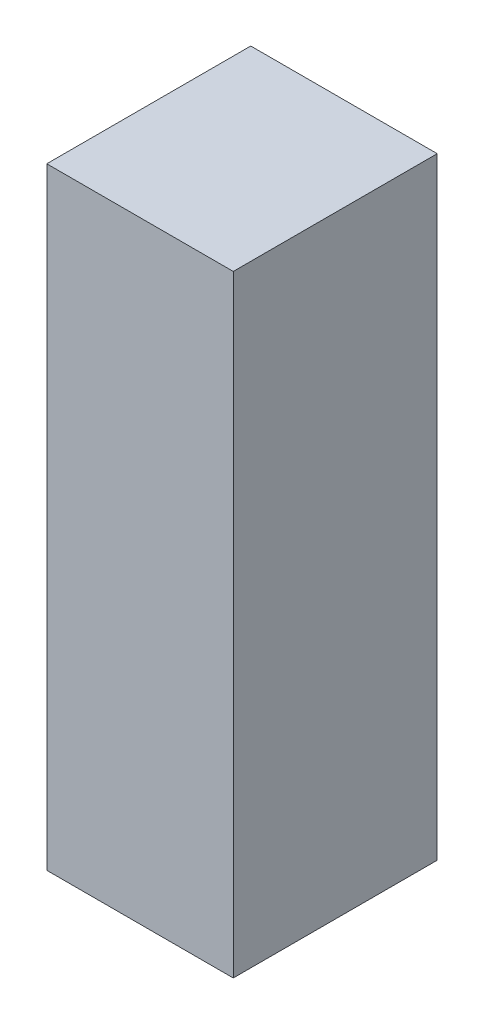
ISO-10303-21;
HEADER;
FILE_DESCRIPTION(('STEP AP214'),'2;1');
FILE_NAME('part.step','',(''),(''),'','','');
FILE_SCHEMA(('AUTOMOTIVE_DESIGN { 1 0 10303 214 1 1 1 1 }'));
ENDSEC;
DATA;
#1=APPLICATION_CONTEXT('core data for automotive mechanical design processes');
#2=APPLICATION_PROTOCOL_DEFINITION('international standard','automotive_design',2000,#1);
#3=PRODUCT_CONTEXT('',#1,'mechanical');
#4=PRODUCT('Part','Part','',(#3));
#5=PRODUCT_RELATED_PRODUCT_CATEGORY('part','',(#4));
#6=PRODUCT_DEFINITION_FORMATION('','',#4);
#7=PRODUCT_DEFINITION_CONTEXT('part definition',#1,'design');
#8=PRODUCT_DEFINITION('design','',#6,#7);
#9=PRODUCT_DEFINITION_SHAPE('','',#8);
#10=(LENGTH_UNIT() NAMED_UNIT(*) SI_UNIT(.MILLI.,.METRE.));
#11=(NAMED_UNIT(*) PLANE_ANGLE_UNIT() SI_UNIT($,.RADIAN.));
#12=(NAMED_UNIT(*) SI_UNIT($,.STERADIAN.) SOLID_ANGLE_UNIT());
#13=UNCERTAINTY_MEASURE_WITH_UNIT(LENGTH_MEASURE(1.E-05),#10,'distance_accuracy_value','');
#14=(GEOMETRIC_REPRESENTATION_CONTEXT(3) GLOBAL_UNCERTAINTY_ASSIGNED_CONTEXT((#13)) GLOBAL_UNIT_ASSIGNED_CONTEXT((#10,
#11,#12)) REPRESENTATION_CONTEXT('',''));
#15=CARTESIAN_POINT('',(0.,0.,0.));
#16=DIRECTION('',(0.,0.,1.));
#17=DIRECTION('',(1.,0.,0.));
#18=AXIS2_PLACEMENT_3D('',#15,#16,#17);
#19=CARTESIAN_POINT('',(0.,105.,0.));
#20=DIRECTION('',(1.,0.,0.));
#21=DIRECTION('',(0.,0.,-1.));
#22=AXIS2_PLACEMENT_3D('',#19,#20,#21);
#23=PLANE('',#22);
#24=DIRECTION('',(0.,0.,1.));
#25=VECTOR('',#24,1.);
#26=CARTESIAN_POINT('',(0.,0.,0.));
#27=LINE('',#26,#25);
#28=CARTESIAN_POINT('',(0.,0.,-35.));
#29=VERTEX_POINT('',#28);
#30=CARTESIAN_POINT('',(0.,0.,0.));
#31=VERTEX_POINT('',#30);
#32=EDGE_CURVE('E96',#29,#31,#27,.T.);
#33=ORIENTED_EDGE('',*,*,#32,.T.);
#34=DIRECTION('',(0.,-1.,0.));
#35=VECTOR('',#34,1.);
#36=CARTESIAN_POINT('',(0.,105.,0.));
#37=LINE('',#36,#35);
#38=CARTESIAN_POINT('',(0.,105.,0.));
#39=VERTEX_POINT('',#38);
#40=EDGE_CURVE('E11',#39,#31,#37,.T.);
#41=ORIENTED_EDGE('',*,*,#40,.F.);
#42=DIRECTION('',(0.,0.,1.));
#43=VECTOR('',#42,1.);
#44=CARTESIAN_POINT('',(0.,105.,0.));
#45=LINE('',#44,#43);
#46=CARTESIAN_POINT('',(0.,105.,-35.));
#47=VERTEX_POINT('',#46);
#48=EDGE_CURVE('E84',#47,#39,#45,.T.);
#49=ORIENTED_EDGE('',*,*,#48,.F.);
#50=DIRECTION('',(0.,-1.,0.));
#51=VECTOR('',#50,1.);
#52=CARTESIAN_POINT('',(0.,105.,-35.));
#53=LINE('',#52,#51);
#54=EDGE_CURVE('E92',#47,#29,#53,.T.);
#55=ORIENTED_EDGE('',*,*,#54,.T.);
#56=EDGE_LOOP('',(#33,#41,#49,#55));
#57=FACE_BOUND('',#56,.T.);
#58=ADVANCED_FACE('F33',(#57),#23,.F.);
#59=CARTESIAN_POINT('',(0.,105.,0.));
#60=DIRECTION('',(0.,0.,-1.));
#61=DIRECTION('',(-1.,0.,0.));
#62=AXIS2_PLACEMENT_3D('',#59,#60,#61);
#63=PLANE('',#62);
#64=DIRECTION('',(1.,0.,0.));
#65=VECTOR('',#64,1.);
#66=CARTESIAN_POINT('',(0.,0.,0.));
#67=LINE('',#66,#65);
#68=CARTESIAN_POINT('',(32.,0.,0.));
#69=VERTEX_POINT('',#68);
#70=EDGE_CURVE('E88',#31,#69,#67,.T.);
#71=ORIENTED_EDGE('',*,*,#70,.T.);
#72=DIRECTION('',(0.,-1.,0.));
#73=VECTOR('',#72,1.);
#74=CARTESIAN_POINT('',(32.,105.,0.));
#75=LINE('',#74,#73);
#76=CARTESIAN_POINT('',(32.,105.,0.));
#77=VERTEX_POINT('',#76);
#78=EDGE_CURVE('E41',#77,#69,#75,.T.);
#79=ORIENTED_EDGE('',*,*,#78,.F.);
#80=DIRECTION('',(1.,0.,0.));
#81=VECTOR('',#80,1.);
#82=CARTESIAN_POINT('',(0.,105.,0.));
#83=LINE('',#82,#81);
#84=EDGE_CURVE('E79',#39,#77,#83,.T.);
#85=ORIENTED_EDGE('',*,*,#84,.F.);
#86=ORIENTED_EDGE('',*,*,#40,.T.);
#87=EDGE_LOOP('',(#71,#79,#85,#86));
#88=FACE_BOUND('',#87,.T.);
#89=ADVANCED_FACE('F87',(#88),#63,.F.);
#90=CARTESIAN_POINT('',(32.,105.,0.));
#91=DIRECTION('',(-1.,0.,0.));
#92=DIRECTION('',(0.,0.,1.));
#93=AXIS2_PLACEMENT_3D('',#90,#91,#92);
#94=PLANE('',#93);
#95=DIRECTION('',(0.,0.,-1.));
#96=VECTOR('',#95,1.);
#97=CARTESIAN_POINT('',(32.,0.,0.));
#98=LINE('',#97,#96);
#99=CARTESIAN_POINT('',(32.,0.,-35.));
#100=VERTEX_POINT('',#99);
#101=EDGE_CURVE('E66',#69,#100,#98,.T.);
#102=ORIENTED_EDGE('',*,*,#101,.T.);
#103=DIRECTION('',(0.,-1.,0.));
#104=VECTOR('',#103,1.);
#105=CARTESIAN_POINT('',(32.,105.,-35.));
#106=LINE('',#105,#104);
#107=CARTESIAN_POINT('',(32.,105.,-35.));
#108=VERTEX_POINT('',#107);
#109=EDGE_CURVE('E89',#108,#100,#106,.T.);
#110=ORIENTED_EDGE('',*,*,#109,.F.);
#111=DIRECTION('',(0.,0.,-1.));
#112=VECTOR('',#111,1.);
#113=CARTESIAN_POINT('',(32.,105.,0.));
#114=LINE('',#113,#112);
#115=EDGE_CURVE('E82',#77,#108,#114,.T.);
#116=ORIENTED_EDGE('',*,*,#115,.F.);
#117=ORIENTED_EDGE('',*,*,#78,.T.);
#118=EDGE_LOOP('',(#102,#110,#116,#117));
#119=FACE_BOUND('',#118,.T.);
#120=ADVANCED_FACE('F90',(#119),#94,.F.);
#121=CARTESIAN_POINT('',(0.,105.,-35.));
#122=DIRECTION('',(0.,0.,1.));
#123=DIRECTION('',(1.,0.,0.));
#124=AXIS2_PLACEMENT_3D('',#121,#122,#123);
#125=PLANE('',#124);
#126=DIRECTION('',(-1.,0.,0.));
#127=VECTOR('',#126,1.);
#128=CARTESIAN_POINT('',(0.,0.,-35.));
#129=LINE('',#128,#127);
#130=EDGE_CURVE('E72',#100,#29,#129,.T.);
#131=ORIENTED_EDGE('',*,*,#130,.T.);
#132=ORIENTED_EDGE('',*,*,#54,.F.);
#133=DIRECTION('',(-1.,0.,0.));
#134=VECTOR('',#133,1.);
#135=CARTESIAN_POINT('',(0.,105.,-35.));
#136=LINE('',#135,#134);
#137=EDGE_CURVE('E49',#108,#47,#136,.T.);
#138=ORIENTED_EDGE('',*,*,#137,.F.);
#139=ORIENTED_EDGE('',*,*,#109,.T.);
#140=EDGE_LOOP('',(#131,#132,#138,#139));
#141=FACE_BOUND('',#140,.T.);
#142=ADVANCED_FACE('F103',(#141),#125,.F.);
#143=CARTESIAN_POINT('',(0.,105.,0.));
#144=DIRECTION('',(0.,-1.,0.));
#145=DIRECTION('',(0.,0.,-1.));
#146=AXIS2_PLACEMENT_3D('',#143,#144,#145);
#147=PLANE('',#146);
#148=ORIENTED_EDGE('',*,*,#48,.T.);
#149=ORIENTED_EDGE('',*,*,#84,.T.);
#150=ORIENTED_EDGE('',*,*,#115,.T.);
#151=ORIENTED_EDGE('',*,*,#137,.T.);
#152=EDGE_LOOP('',(#148,#149,#150,#151));
#153=FACE_BOUND('',#152,.T.);
#154=ADVANCED_FACE('F80',(#153),#147,.F.);
#155=CARTESIAN_POINT('',(0.,0.,0.));
#156=DIRECTION('',(0.,-1.,0.));
#157=DIRECTION('',(0.,0.,-1.));
#158=AXIS2_PLACEMENT_3D('',#155,#156,#157);
#159=PLANE('',#158);
#160=ORIENTED_EDGE('',*,*,#32,.F.);
#161=ORIENTED_EDGE('',*,*,#130,.F.);
#162=ORIENTED_EDGE('',*,*,#101,.F.);
#163=ORIENTED_EDGE('',*,*,#70,.F.);
#164=EDGE_LOOP('',(#160,#161,#162,#163));
#165=FACE_BOUND('',#164,.T.);
#166=ADVANCED_FACE('F106',(#165),#159,.T.);
#167=CLOSED_SHELL('',(#58,#89,#120,#142,#154,#166));
#168=MANIFOLD_SOLID_BREP('B2',#167);
#169=ADVANCED_BREP_SHAPE_REPRESENTATION('',(#18,#168),#14);
#170=SHAPE_DEFINITION_REPRESENTATION(#9,#169);
ENDSEC;
END-ISO-10303-21;
